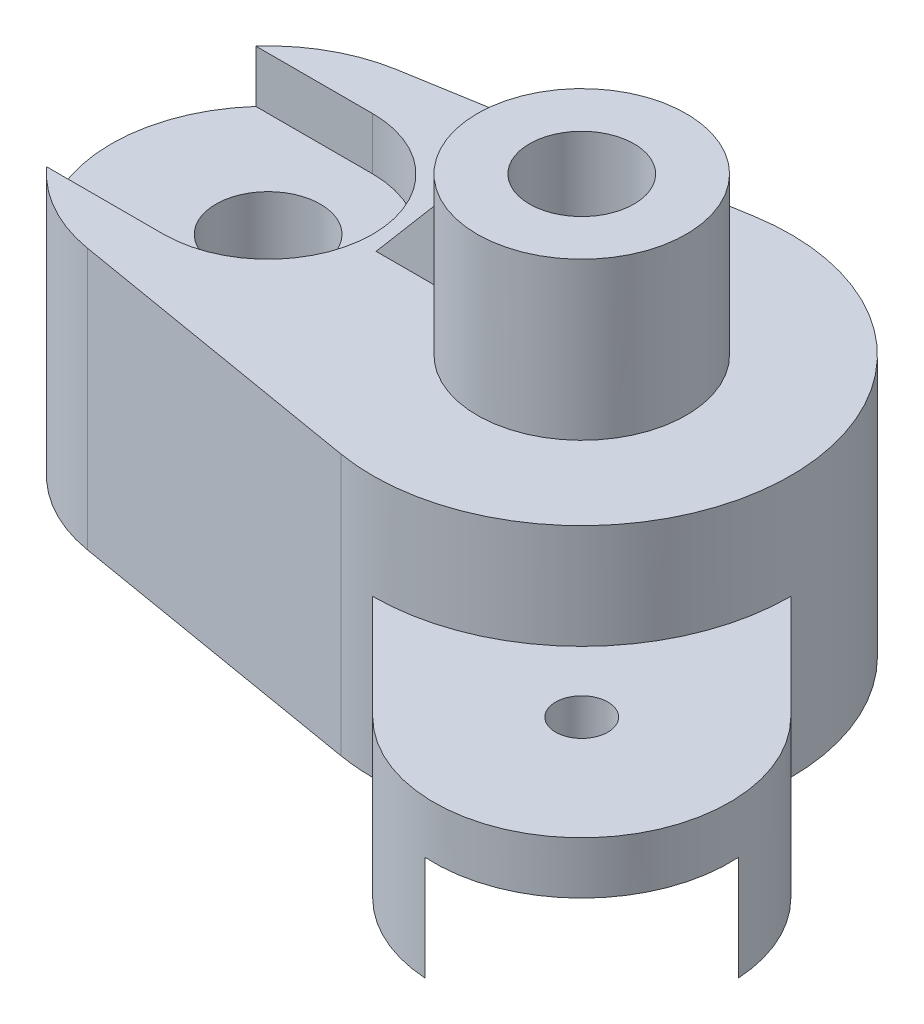
ISO-10303-21;
HEADER;
FILE_DESCRIPTION(('STEP AP214'),'2;1');
FILE_NAME('part.step','',(''),(''),'','','');
FILE_SCHEMA(('AUTOMOTIVE_DESIGN { 1 0 10303 214 1 1 1 1 }'));
ENDSEC;
DATA;
#1=APPLICATION_CONTEXT('core data for automotive mechanical design processes');
#2=APPLICATION_PROTOCOL_DEFINITION('international standard','automotive_design',2000,#1);
#3=PRODUCT_CONTEXT('',#1,'mechanical');
#4=PRODUCT('Part','Part','',(#3));
#5=PRODUCT_RELATED_PRODUCT_CATEGORY('part','',(#4));
#6=PRODUCT_DEFINITION_FORMATION('','',#4);
#7=PRODUCT_DEFINITION_CONTEXT('part definition',#1,'design');
#8=PRODUCT_DEFINITION('design','',#6,#7);
#9=PRODUCT_DEFINITION_SHAPE('','',#8);
#10=(LENGTH_UNIT() NAMED_UNIT(*) SI_UNIT(.MILLI.,.METRE.));
#11=(NAMED_UNIT(*) PLANE_ANGLE_UNIT() SI_UNIT($,.RADIAN.));
#12=(NAMED_UNIT(*) SI_UNIT($,.STERADIAN.) SOLID_ANGLE_UNIT());
#13=UNCERTAINTY_MEASURE_WITH_UNIT(LENGTH_MEASURE(1.E-05),#10,'distance_accuracy_value','');
#14=(GEOMETRIC_REPRESENTATION_CONTEXT(3) GLOBAL_UNCERTAINTY_ASSIGNED_CONTEXT((#13)) GLOBAL_UNIT_ASSIGNED_CONTEXT((#10,
#11,#12)) REPRESENTATION_CONTEXT('',''));
#15=CARTESIAN_POINT('',(0.,0.,0.));
#16=DIRECTION('',(0.,0.,1.));
#17=DIRECTION('',(1.,0.,0.));
#18=AXIS2_PLACEMENT_3D('',#15,#16,#17);
#19=CARTESIAN_POINT('',(0.,0.,0.));
#20=DIRECTION('',(0.,1.,0.));
#21=DIRECTION('',(0.,0.,1.));
#22=AXIS2_PLACEMENT_3D('',#19,#20,#21);
#23=PLANE('',#22);
#24=CARTESIAN_POINT('',(0.,0.,0.));
#25=DIRECTION('',(0.,-1.,0.));
#26=DIRECTION('',(0.,0.,-1.));
#27=AXIS2_PLACEMENT_3D('',#24,#25,#26);
#28=CIRCLE('',#27,30.);
#29=CARTESIAN_POINT('',(-22.3606797749979,0.,-20.));
#30=VERTEX_POINT('',#29);
#31=CARTESIAN_POINT('',(30.,0.,0.));
#32=VERTEX_POINT('',#31);
#33=EDGE_CURVE('E330',#30,#32,#28,.T.);
#34=ORIENTED_EDGE('',*,*,#33,.F.);
#35=DIRECTION('',(1.,0.,0.));
#36=VECTOR('',#35,1.);
#37=CARTESIAN_POINT('',(-105.611257837437,0.,-20.));
#38=LINE('',#37,#36);
#39=CARTESIAN_POINT('',(-82.3606797749979,0.,-20.));
#40=VERTEX_POINT('',#39);
#41=EDGE_CURVE('E423',#40,#30,#38,.T.);
#42=ORIENTED_EDGE('',*,*,#41,.F.);
#43=CARTESIAN_POINT('',(-60.,0.,0.));
#44=DIRECTION('',(0.,1.,0.));
#45=DIRECTION('',(0.,0.,1.));
#46=AXIS2_PLACEMENT_3D('',#43,#44,#45);
#47=CIRCLE('',#46,30.);
#48=CARTESIAN_POINT('',(-65.,0.,-29.5803989154981));
#49=VERTEX_POINT('',#48);
#50=EDGE_CURVE('E356',#49,#40,#47,.T.);
#51=ORIENTED_EDGE('',*,*,#50,.F.);
#52=DIRECTION('',(-0.986013297183269,0.,0.166666666666667));
#53=VECTOR('',#52,1.);
#54=CARTESIAN_POINT('',(-6.66666666666667,0.,-39.4405318873308));
#55=LINE('',#54,#53);
#56=CARTESIAN_POINT('',(-6.66666666666667,0.,-39.4405318873308));
#57=VERTEX_POINT('',#56);
#58=EDGE_CURVE('E335',#57,#49,#55,.T.);
#59=ORIENTED_EDGE('',*,*,#58,.F.);
#60=CARTESIAN_POINT('',(0.,0.,0.));
#61=DIRECTION('',(0.,1.,0.));
#62=DIRECTION('',(0.,0.,1.));
#63=AXIS2_PLACEMENT_3D('',#60,#61,#62);
#64=CIRCLE('',#63,40.);
#65=CARTESIAN_POINT('',(40.,0.,0.));
#66=VERTEX_POINT('',#65);
#67=EDGE_CURVE('E362',#66,#57,#64,.T.);
#68=ORIENTED_EDGE('',*,*,#67,.F.);
#69=DIRECTION('',(0.707106781186551,0.,0.707106781186544));
#70=VECTOR('',#69,1.);
#71=CARTESIAN_POINT('',(19.9999999999998,0.,-20.));
#72=LINE('',#71,#70);
#73=CARTESIAN_POINT('',(59.9999999999999,0.,19.9999999999997));
#74=VERTEX_POINT('',#73);
#75=EDGE_CURVE('E257',#66,#74,#72,.T.);
#76=ORIENTED_EDGE('',*,*,#75,.T.);
#77=CARTESIAN_POINT('',(40.,0.,39.9999999999996));
#78=DIRECTION('',(0.,-1.,0.));
#79=DIRECTION('',(0.,0.,-1.));
#80=AXIS2_PLACEMENT_3D('',#77,#78,#79);
#81=CIRCLE('',#80,28.2842712474619);
#82=CARTESIAN_POINT('',(68.228756555323,0.,38.2287565553237));
#83=VERTEX_POINT('',#82);
#84=EDGE_CURVE('E274',#74,#83,#81,.T.);
#85=ORIENTED_EDGE('',*,*,#84,.T.);
#86=DIRECTION('',(-0.707106781186542,0.,-0.707106781186554));
#87=VECTOR('',#86,1.);
#88=CARTESIAN_POINT('',(15.0000000000002,0.,-15.));
#89=LINE('',#88,#87);
#90=EDGE_CURVE('E220',#83,#32,#89,.T.);
#91=ORIENTED_EDGE('',*,*,#90,.T.);
#92=EDGE_LOOP('',(#34,#42,#51,#59,#68,#76,#85,#91));
#93=FACE_BOUND('',#92,.T.);
#94=ADVANCED_FACE('F35',(#93),#23,.F.);
#95=CARTESIAN_POINT('',(0.,50.,0.));
#96=DIRECTION('',(0.,1.,0.));
#97=DIRECTION('',(0.,0.,1.));
#98=AXIS2_PLACEMENT_3D('',#95,#96,#97);
#99=PLANE('',#98);
#100=DIRECTION('',(0.,0.,1.));
#101=VECTOR('',#100,1.);
#102=CARTESIAN_POINT('',(-36.8431348329844,50.,-2.5));
#103=LINE('',#102,#101);
#104=CARTESIAN_POINT('',(-36.8431348329844,50.,-2.5));
#105=VERTEX_POINT('',#104);
#106=CARTESIAN_POINT('',(-36.8431348329844,50.,2.5));
#107=VERTEX_POINT('',#106);
#108=EDGE_CURVE('E58',#105,#107,#103,.T.);
#109=ORIENTED_EDGE('',*,*,#108,.F.);
#110=DIRECTION('',(-1.,0.,0.));
#111=VECTOR('',#110,1.);
#112=CARTESIAN_POINT('',(-19.8431348329844,50.,-2.49999999999999));
#113=LINE('',#112,#111);
#114=CARTESIAN_POINT('',(-19.8431348329844,50.,-2.49999999999999));
#115=VERTEX_POINT('',#114);
#116=EDGE_CURVE('E440',#115,#105,#113,.T.);
#117=ORIENTED_EDGE('',*,*,#116,.F.);
#118=CARTESIAN_POINT('',(0.,50.,0.));
#119=DIRECTION('',(0.,1.,0.));
#120=DIRECTION('',(0.,0.,1.));
#121=AXIS2_PLACEMENT_3D('',#118,#119,#120);
#122=CIRCLE('',#121,20.);
#123=CARTESIAN_POINT('',(-19.8431348329844,50.,2.5));
#124=VERTEX_POINT('',#123);
#125=EDGE_CURVE('E326',#124,#115,#122,.T.);
#126=ORIENTED_EDGE('',*,*,#125,.F.);
#127=DIRECTION('',(1.,0.,0.));
#128=VECTOR('',#127,1.);
#129=CARTESIAN_POINT('',(-19.8431348329844,50.,2.5));
#130=LINE('',#129,#128);
#131=EDGE_CURVE('E218',#107,#124,#130,.T.);
#132=ORIENTED_EDGE('',*,*,#131,.F.);
#133=EDGE_LOOP('',(#109,#117,#126,#132));
#134=FACE_BOUND('',#133,.T.);
#135=CARTESIAN_POINT('',(-60.,50.,0.));
#136=DIRECTION('',(0.,1.,0.));
#137=DIRECTION('',(0.,0.,1.));
#138=AXIS2_PLACEMENT_3D('',#135,#136,#137);
#139=CIRCLE('',#138,20.);
#140=CARTESIAN_POINT('',(-60.,50.,-20.));
#141=VERTEX_POINT('',#140);
#142=CARTESIAN_POINT('',(-60.,50.,20.));
#143=VERTEX_POINT('',#142);
#144=EDGE_CURVE('E282',#141,#143,#139,.F.);
#145=ORIENTED_EDGE('',*,*,#144,.T.);
#146=DIRECTION('',(-1.,0.,0.));
#147=VECTOR('',#146,1.);
#148=CARTESIAN_POINT('',(0.,50.,20.));
#149=LINE('',#148,#147);
#150=CARTESIAN_POINT('',(-82.3606797749978,50.,20.));
#151=VERTEX_POINT('',#150);
#152=EDGE_CURVE('E294',#143,#151,#149,.T.);
#153=ORIENTED_EDGE('',*,*,#152,.T.);
#154=CARTESIAN_POINT('',(-60.,50.,0.));
#155=DIRECTION('',(0.,1.,0.));
#156=DIRECTION('',(0.,0.,-1.));
#157=AXIS2_PLACEMENT_3D('',#154,#155,#156);
#158=CIRCLE('',#157,29.9999999999999);
#159=CARTESIAN_POINT('',(-65.,50.,29.5803989154981));
#160=VERTEX_POINT('',#159);
#161=EDGE_CURVE('E345',#151,#160,#158,.T.);
#162=ORIENTED_EDGE('',*,*,#161,.T.);
#163=DIRECTION('',(0.986013297183269,0.,0.166666666666667));
#164=VECTOR('',#163,1.);
#165=CARTESIAN_POINT('',(-65.,50.,29.5803989154981));
#166=LINE('',#165,#164);
#167=CARTESIAN_POINT('',(-6.66666666666666,50.,39.4405318873308));
#168=VERTEX_POINT('',#167);
#169=EDGE_CURVE('E349',#160,#168,#166,.T.);
#170=ORIENTED_EDGE('',*,*,#169,.T.);
#171=CARTESIAN_POINT('',(0.,50.,0.));
#172=DIRECTION('',(0.,1.,0.));
#173=DIRECTION('',(0.,0.,1.));
#174=AXIS2_PLACEMENT_3D('',#171,#172,#173);
#175=CIRCLE('',#174,40.);
#176=CARTESIAN_POINT('',(-6.66666666666667,50.,-39.4405318873308));
#177=VERTEX_POINT('',#176);
#178=EDGE_CURVE('E339',#168,#177,#175,.T.);
#179=ORIENTED_EDGE('',*,*,#178,.T.);
#180=DIRECTION('',(-0.986013297183269,0.,0.166666666666667));
#181=VECTOR('',#180,1.);
#182=CARTESIAN_POINT('',(-6.66666666666667,50.,-39.4405318873308));
#183=LINE('',#182,#181);
#184=CARTESIAN_POINT('',(-65.,50.,-29.5803989154981));
#185=VERTEX_POINT('',#184);
#186=EDGE_CURVE('E342',#177,#185,#183,.T.);
#187=ORIENTED_EDGE('',*,*,#186,.T.);
#188=CARTESIAN_POINT('',(-82.3606797749979,50.,-20.));
#189=VERTEX_POINT('',#188);
#190=EDGE_CURVE('E346',#185,#189,#158,.T.);
#191=ORIENTED_EDGE('',*,*,#190,.T.);
#192=DIRECTION('',(-1.,0.,0.));
#193=VECTOR('',#192,1.);
#194=CARTESIAN_POINT('',(0.,50.,-20.));
#195=LINE('',#194,#193);
#196=EDGE_CURVE('E307',#141,#189,#195,.T.);
#197=ORIENTED_EDGE('',*,*,#196,.F.);
#198=EDGE_LOOP('',(#145,#153,#162,#170,#179,#187,#191,#197));
#199=FACE_BOUND('',#198,.T.);
#200=ADVANCED_FACE('F400',(#134,#199),#99,.T.);
#201=CARTESIAN_POINT('',(0.,80.,0.));
#202=DIRECTION('',(0.,-1.,0.));
#203=DIRECTION('',(0.,0.,-1.));
#204=AXIS2_PLACEMENT_3D('',#201,#202,#203);
#205=CYLINDRICAL_SURFACE('',#204,20.);
#206=CARTESIAN_POINT('',(0.,80.,0.));
#207=DIRECTION('',(0.,1.,0.));
#208=DIRECTION('',(0.,0.,1.));
#209=AXIS2_PLACEMENT_3D('',#206,#207,#208);
#210=CIRCLE('',#209,20.);
#211=CARTESIAN_POINT('',(0.,80.,20.));
#212=VERTEX_POINT('',#211);
#213=EDGE_CURVE('E327',#212,#212,#210,.T.);
#214=ORIENTED_EDGE('',*,*,#213,.F.);
#215=EDGE_LOOP('',(#214));
#216=FACE_BOUND('',#215,.T.);
#217=DIRECTION('',(0.,-1.,0.));
#218=VECTOR('',#217,1.);
#219=CARTESIAN_POINT('',(-19.8431348329844,70.,-2.49999999999999));
#220=LINE('',#219,#218);
#221=CARTESIAN_POINT('',(-19.8431348329844,70.,-2.5));
#222=VERTEX_POINT('',#221);
#223=EDGE_CURVE('E214',#222,#115,#220,.T.);
#224=ORIENTED_EDGE('',*,*,#223,.F.);
#225=CARTESIAN_POINT('',(0.,70.,0.));
#226=DIRECTION('',(0.,-1.,0.));
#227=DIRECTION('',(0.,0.,-1.));
#228=AXIS2_PLACEMENT_3D('',#225,#226,#227);
#229=CIRCLE('',#228,20.);
#230=CARTESIAN_POINT('',(-19.8431348329844,70.,2.50000000000001));
#231=VERTEX_POINT('',#230);
#232=EDGE_CURVE('E196',#231,#222,#229,.T.);
#233=ORIENTED_EDGE('',*,*,#232,.F.);
#234=DIRECTION('',(0.,-1.,0.));
#235=VECTOR('',#234,1.);
#236=CARTESIAN_POINT('',(-19.8431348329844,70.,2.5));
#237=LINE('',#236,#235);
#238=EDGE_CURVE('E211',#231,#124,#237,.T.);
#239=ORIENTED_EDGE('',*,*,#238,.T.);
#240=ORIENTED_EDGE('',*,*,#125,.T.);
#241=EDGE_LOOP('',(#224,#233,#239,#240));
#242=FACE_BOUND('',#241,.T.);
#243=ADVANCED_FACE('F209',(#216,#242),#205,.T.);
#244=CARTESIAN_POINT('',(-82.3606797749979,0.,20.));
#245=VERTEX_POINT('',#244);
#246=CARTESIAN_POINT('',(-65.,0.,29.5803989154981));
#247=VERTEX_POINT('',#246);
#248=EDGE_CURVE('E355',#245,#247,#47,.T.);
#249=ORIENTED_EDGE('',*,*,#248,.F.);
#250=DIRECTION('',(-1.,0.,0.));
#251=VECTOR('',#250,1.);
#252=CARTESIAN_POINT('',(-105.611257837437,0.,20.));
#253=LINE('',#252,#251);
#254=CARTESIAN_POINT('',(-22.3606797749979,0.,20.));
#255=VERTEX_POINT('',#254);
#256=EDGE_CURVE('E390',#255,#245,#253,.T.);
#257=ORIENTED_EDGE('',*,*,#256,.F.);
#258=CARTESIAN_POINT('',(0.,0.,30.));
#259=VERTEX_POINT('',#258);
#260=EDGE_CURVE('E336',#259,#255,#28,.T.);
#261=ORIENTED_EDGE('',*,*,#260,.F.);
#262=DIRECTION('',(-0.707106781186541,0.,-0.707106781186554));
#263=VECTOR('',#262,1.);
#264=CARTESIAN_POINT('',(-15.,0.,14.9999999999997));
#265=LINE('',#264,#263);
#266=CARTESIAN_POINT('',(38.2287565553218,0.,68.2287565553225));
#267=VERTEX_POINT('',#266);
#268=EDGE_CURVE('E228',#267,#259,#265,.T.);
#269=ORIENTED_EDGE('',*,*,#268,.F.);
#270=CARTESIAN_POINT('',(20.0000000000001,0.,59.9999999999999));
#271=VERTEX_POINT('',#270);
#272=EDGE_CURVE('E273',#267,#271,#81,.T.);
#273=ORIENTED_EDGE('',*,*,#272,.T.);
#274=DIRECTION('',(0.707106781186551,0.,0.707106781186544));
#275=VECTOR('',#274,1.);
#276=CARTESIAN_POINT('',(-20.,0.,20.0000000000002));
#277=LINE('',#276,#275);
#278=CARTESIAN_POINT('',(0.,0.,40.));
#279=VERTEX_POINT('',#278);
#280=EDGE_CURVE('E262',#279,#271,#277,.T.);
#281=ORIENTED_EDGE('',*,*,#280,.F.);
#282=CARTESIAN_POINT('',(-6.66666666666666,0.,39.4405318873308));
#283=VERTEX_POINT('',#282);
#284=EDGE_CURVE('E343',#283,#279,#64,.T.);
#285=ORIENTED_EDGE('',*,*,#284,.F.);
#286=DIRECTION('',(0.986013297183269,0.,0.166666666666667));
#287=VECTOR('',#286,1.);
#288=CARTESIAN_POINT('',(-65.,0.,29.5803989154981));
#289=LINE('',#288,#287);
#290=EDGE_CURVE('E359',#247,#283,#289,.T.);
#291=ORIENTED_EDGE('',*,*,#290,.F.);
#292=EDGE_LOOP('',(#249,#257,#261,#269,#273,#281,#285,#291));
#293=FACE_BOUND('',#292,.T.);
#294=ADVANCED_FACE('F388',(#293),#23,.F.);
#295=CARTESIAN_POINT('',(0.,30.,0.));
#296=DIRECTION('',(0.,-1.,0.));
#297=DIRECTION('',(0.,0.,-1.));
#298=AXIS2_PLACEMENT_3D('',#295,#296,#297);
#299=CYLINDRICAL_SURFACE('',#298,30.);
#300=CARTESIAN_POINT('',(0.,30.,0.));
#301=DIRECTION('',(0.,-1.,0.));
#302=DIRECTION('',(0.,0.,-1.));
#303=AXIS2_PLACEMENT_3D('',#300,#301,#302);
#304=CIRCLE('',#303,30.);
#305=CARTESIAN_POINT('',(0.,30.,-30.));
#306=VERTEX_POINT('',#305);
#307=EDGE_CURVE('E332',#306,#306,#304,.T.);
#308=ORIENTED_EDGE('',*,*,#307,.F.);
#309=EDGE_LOOP('',(#308));
#310=FACE_BOUND('',#309,.T.);
#311=CARTESIAN_POINT('',(0.,20.,0.));
#312=DIRECTION('',(0.,1.,0.));
#313=DIRECTION('',(0.,0.,1.));
#314=AXIS2_PLACEMENT_3D('',#311,#312,#313);
#315=CIRCLE('',#314,30.);
#316=CARTESIAN_POINT('',(-22.3606797749979,20.,20.));
#317=VERTEX_POINT('',#316);
#318=CARTESIAN_POINT('',(-22.3606797749979,20.,-20.));
#319=VERTEX_POINT('',#318);
#320=EDGE_CURVE('E432',#317,#319,#315,.F.);
#321=ORIENTED_EDGE('',*,*,#320,.T.);
#322=DIRECTION('',(0.,-1.,0.));
#323=VECTOR('',#322,1.);
#324=CARTESIAN_POINT('',(-22.3606797749979,30.,-20.));
#325=LINE('',#324,#323);
#326=EDGE_CURVE('E438',#319,#30,#325,.T.);
#327=ORIENTED_EDGE('',*,*,#326,.T.);
#328=ORIENTED_EDGE('',*,*,#33,.T.);
#329=DIRECTION('',(0.,-1.,0.));
#330=VECTOR('',#329,1.);
#331=CARTESIAN_POINT('',(30.,20.,0.));
#332=LINE('',#331,#330);
#333=CARTESIAN_POINT('',(30.,20.,0.));
#334=VERTEX_POINT('',#333);
#335=EDGE_CURVE('E244',#334,#32,#332,.T.);
#336=ORIENTED_EDGE('',*,*,#335,.F.);
#337=CARTESIAN_POINT('',(0.,20.,0.));
#338=DIRECTION('',(0.,-1.,0.));
#339=DIRECTION('',(0.,0.,-1.));
#340=AXIS2_PLACEMENT_3D('',#337,#338,#339);
#341=CIRCLE('',#340,30.);
#342=CARTESIAN_POINT('',(0.,20.,30.));
#343=VERTEX_POINT('',#342);
#344=EDGE_CURVE('E234',#343,#334,#341,.F.);
#345=ORIENTED_EDGE('',*,*,#344,.F.);
#346=DIRECTION('',(0.,-1.,0.));
#347=VECTOR('',#346,1.);
#348=CARTESIAN_POINT('',(0.,20.,30.));
#349=LINE('',#348,#347);
#350=EDGE_CURVE('E248',#343,#259,#349,.T.);
#351=ORIENTED_EDGE('',*,*,#350,.T.);
#352=ORIENTED_EDGE('',*,*,#260,.T.);
#353=DIRECTION('',(0.,-1.,0.));
#354=VECTOR('',#353,1.);
#355=CARTESIAN_POINT('',(-22.3606797749979,30.,20.));
#356=LINE('',#355,#354);
#357=EDGE_CURVE('E435',#255,#317,#356,.F.);
#358=ORIENTED_EDGE('',*,*,#357,.T.);
#359=EDGE_LOOP('',(#321,#327,#328,#336,#345,#351,#352,#358));
#360=FACE_BOUND('',#359,.T.);
#361=ADVANCED_FACE('F455',(#310,#360),#299,.F.);
#362=CARTESIAN_POINT('',(40.,30.,39.9999999999996));
#363=DIRECTION('',(0.,-1.,0.));
#364=DIRECTION('',(0.,0.,-1.));
#365=AXIS2_PLACEMENT_3D('',#362,#363,#364);
#366=CYLINDRICAL_SURFACE('',#365,28.2842712474619);
#367=CARTESIAN_POINT('',(40.,20.,39.9999999999996));
#368=DIRECTION('',(0.,-1.,0.));
#369=DIRECTION('',(0.,0.,-1.));
#370=AXIS2_PLACEMENT_3D('',#367,#368,#369);
#371=CIRCLE('',#370,28.2842712474619);
#372=CARTESIAN_POINT('',(68.228756555323,20.,38.2287565553237));
#373=VERTEX_POINT('',#372);
#374=CARTESIAN_POINT('',(38.2287565553218,20.,68.2287565553225));
#375=VERTEX_POINT('',#374);
#376=EDGE_CURVE('E227',#373,#375,#371,.T.);
#377=ORIENTED_EDGE('',*,*,#376,.F.);
#378=DIRECTION('',(0.,-1.,0.));
#379=VECTOR('',#378,1.);
#380=CARTESIAN_POINT('',(68.228756555323,20.,38.2287565553237));
#381=LINE('',#380,#379);
#382=EDGE_CURVE('E240',#373,#83,#381,.T.);
#383=ORIENTED_EDGE('',*,*,#382,.T.);
#384=ORIENTED_EDGE('',*,*,#84,.F.);
#385=DIRECTION('',(0.,-1.,0.));
#386=VECTOR('',#385,1.);
#387=CARTESIAN_POINT('',(59.9999999999999,30.,19.9999999999997));
#388=LINE('',#387,#386);
#389=CARTESIAN_POINT('',(59.9999999999999,30.,19.9999999999997));
#390=VERTEX_POINT('',#389);
#391=EDGE_CURVE('E270',#390,#74,#388,.T.);
#392=ORIENTED_EDGE('',*,*,#391,.F.);
#393=CARTESIAN_POINT('',(40.,30.,39.9999999999996));
#394=DIRECTION('',(0.,-1.,0.));
#395=DIRECTION('',(0.,0.,-1.));
#396=AXIS2_PLACEMENT_3D('',#393,#394,#395);
#397=CIRCLE('',#396,28.2842712474619);
#398=CARTESIAN_POINT('',(20.0000000000001,30.,59.9999999999999));
#399=VERTEX_POINT('',#398);
#400=EDGE_CURVE('E261',#390,#399,#397,.T.);
#401=ORIENTED_EDGE('',*,*,#400,.T.);
#402=DIRECTION('',(0.,-1.,0.));
#403=VECTOR('',#402,1.);
#404=CARTESIAN_POINT('',(20.0000000000001,30.,59.9999999999999));
#405=LINE('',#404,#403);
#406=EDGE_CURVE('E286',#399,#271,#405,.T.);
#407=ORIENTED_EDGE('',*,*,#406,.T.);
#408=ORIENTED_EDGE('',*,*,#272,.F.);
#409=DIRECTION('',(0.,-1.,0.));
#410=VECTOR('',#409,1.);
#411=CARTESIAN_POINT('',(38.2287565553218,20.,68.2287565553225));
#412=LINE('',#411,#410);
#413=EDGE_CURVE('E251',#375,#267,#412,.T.);
#414=ORIENTED_EDGE('',*,*,#413,.F.);
#415=EDGE_LOOP('',(#377,#383,#384,#392,#401,#407,#408,#414));
#416=FACE_BOUND('',#415,.T.);
#417=ADVANCED_FACE('F472',(#416),#366,.T.);
#418=CARTESIAN_POINT('',(40.,30.,39.9999999999996));
#419=DIRECTION('',(0.,-1.,0.));
#420=DIRECTION('',(0.,0.,-1.));
#421=AXIS2_PLACEMENT_3D('',#418,#419,#420);
#422=CYLINDRICAL_SURFACE('',#421,5.);
#423=CARTESIAN_POINT('',(40.,30.,39.9999999999996));
#424=DIRECTION('',(0.,-1.,0.));
#425=DIRECTION('',(0.,0.,-1.));
#426=AXIS2_PLACEMENT_3D('',#423,#424,#425);
#427=CIRCLE('',#426,5.);
#428=CARTESIAN_POINT('',(40.,30.,34.9999999999996));
#429=VERTEX_POINT('',#428);
#430=EDGE_CURVE('E247',#429,#429,#427,.T.);
#431=ORIENTED_EDGE('',*,*,#430,.F.);
#432=EDGE_LOOP('',(#431));
#433=FACE_BOUND('',#432,.T.);
#434=CARTESIAN_POINT('',(40.,20.,39.9999999999996));
#435=DIRECTION('',(0.,-1.,0.));
#436=DIRECTION('',(0.,0.,-1.));
#437=AXIS2_PLACEMENT_3D('',#434,#435,#436);
#438=CIRCLE('',#437,5.);
#439=CARTESIAN_POINT('',(40.,20.,34.9999999999996));
#440=VERTEX_POINT('',#439);
#441=EDGE_CURVE('E237',#440,#440,#438,.F.);
#442=ORIENTED_EDGE('',*,*,#441,.F.);
#443=EDGE_LOOP('',(#442));
#444=FACE_BOUND('',#443,.T.);
#445=ADVANCED_FACE('F465',(#433,#444),#422,.F.);
#446=CARTESIAN_POINT('',(-60.,50.,0.));
#447=DIRECTION('',(0.,-1.,0.));
#448=DIRECTION('',(0.,0.,-1.));
#449=AXIS2_PLACEMENT_3D('',#446,#447,#448);
#450=CYLINDRICAL_SURFACE('',#449,30.);
#451=ORIENTED_EDGE('',*,*,#50,.T.);
#452=DIRECTION('',(0.,-1.,0.));
#453=VECTOR('',#452,1.);
#454=CARTESIAN_POINT('',(-82.3606797749979,50.,-20.));
#455=LINE('',#454,#453);
#456=CARTESIAN_POINT('',(-82.3606797749979,20.,-20.));
#457=VERTEX_POINT('',#456);
#458=EDGE_CURVE('E11',#40,#457,#455,.F.);
#459=ORIENTED_EDGE('',*,*,#458,.T.);
#460=CARTESIAN_POINT('',(-60.,20.,0.));
#461=DIRECTION('',(0.,1.,0.));
#462=DIRECTION('',(0.,0.,1.));
#463=AXIS2_PLACEMENT_3D('',#460,#461,#462);
#464=CIRCLE('',#463,30.);
#465=CARTESIAN_POINT('',(-82.3606797749979,20.,20.));
#466=VERTEX_POINT('',#465);
#467=EDGE_CURVE('E376',#457,#466,#464,.T.);
#468=ORIENTED_EDGE('',*,*,#467,.T.);
#469=DIRECTION('',(0.,-1.,0.));
#470=VECTOR('',#469,1.);
#471=CARTESIAN_POINT('',(-82.3606797749979,50.,20.));
#472=LINE('',#471,#470);
#473=EDGE_CURVE('E43',#466,#245,#472,.T.);
#474=ORIENTED_EDGE('',*,*,#473,.T.);
#475=ORIENTED_EDGE('',*,*,#248,.T.);
#476=DIRECTION('',(0.,-1.,0.));
#477=VECTOR('',#476,1.);
#478=CARTESIAN_POINT('',(-65.,50.,29.5803989154981));
#479=LINE('',#478,#477);
#480=EDGE_CURVE('E366',#160,#247,#479,.T.);
#481=ORIENTED_EDGE('',*,*,#480,.F.);
#482=ORIENTED_EDGE('',*,*,#161,.F.);
#483=DIRECTION('',(0.,1.,0.));
#484=VECTOR('',#483,1.);
#485=CARTESIAN_POINT('',(-82.3606797749978,40.,20.));
#486=LINE('',#485,#484);
#487=CARTESIAN_POINT('',(-82.3606797749978,40.,20.));
#488=VERTEX_POINT('',#487);
#489=EDGE_CURVE('E315',#488,#151,#486,.T.);
#490=ORIENTED_EDGE('',*,*,#489,.F.);
#491=CARTESIAN_POINT('',(-60.,40.,0.));
#492=DIRECTION('',(0.,1.,0.));
#493=DIRECTION('',(0.,0.,1.));
#494=AXIS2_PLACEMENT_3D('',#491,#492,#493);
#495=CIRCLE('',#494,29.9999999999999);
#496=CARTESIAN_POINT('',(-82.3606797749979,40.,-20.));
#497=VERTEX_POINT('',#496);
#498=EDGE_CURVE('E296',#497,#488,#495,.T.);
#499=ORIENTED_EDGE('',*,*,#498,.F.);
#500=DIRECTION('',(0.,1.,0.));
#501=VECTOR('',#500,1.);
#502=CARTESIAN_POINT('',(-82.3606797749979,40.,-20.));
#503=LINE('',#502,#501);
#504=EDGE_CURVE('E317',#497,#189,#503,.T.);
#505=ORIENTED_EDGE('',*,*,#504,.T.);
#506=ORIENTED_EDGE('',*,*,#190,.F.);
#507=DIRECTION('',(0.,-1.,0.));
#508=VECTOR('',#507,1.);
#509=CARTESIAN_POINT('',(-65.,50.,-29.5803989154981));
#510=LINE('',#509,#508);
#511=EDGE_CURVE('E369',#185,#49,#510,.T.);
#512=ORIENTED_EDGE('',*,*,#511,.T.);
#513=EDGE_LOOP('',(#451,#459,#468,#474,#475,#481,#482,#490,#499,#505,#506,#512));
#514=FACE_BOUND('',#513,.T.);
#515=ADVANCED_FACE('F382',(#514),#450,.T.);
#516=CARTESIAN_POINT('',(-60.,-59.,0.));
#517=DIRECTION('',(0.,1.,0.));
#518=DIRECTION('',(0.,0.,1.));
#519=AXIS2_PLACEMENT_3D('',#516,#517,#518);
#520=CYLINDRICAL_SURFACE('',#519,10.);
#521=CARTESIAN_POINT('',(-60.,20.,0.));
#522=DIRECTION('',(0.,1.,0.));
#523=DIRECTION('',(0.,0.,1.));
#524=AXIS2_PLACEMENT_3D('',#521,#522,#523);
#525=CIRCLE('',#524,10.);
#526=CARTESIAN_POINT('',(-60.,20.,9.99999999999997));
#527=VERTEX_POINT('',#526);
#528=EDGE_CURVE('E374',#527,#527,#525,.F.);
#529=ORIENTED_EDGE('',*,*,#528,.T.);
#530=EDGE_LOOP('',(#529));
#531=FACE_BOUND('',#530,.T.);
#532=CARTESIAN_POINT('',(-60.,40.,0.));
#533=DIRECTION('',(0.,1.,0.));
#534=DIRECTION('',(0.,0.,1.));
#535=AXIS2_PLACEMENT_3D('',#532,#533,#534);
#536=CIRCLE('',#535,10.);
#537=CARTESIAN_POINT('',(-60.,40.,9.99999999999997));
#538=VERTEX_POINT('',#537);
#539=EDGE_CURVE('E301',#538,#538,#536,.F.);
#540=ORIENTED_EDGE('',*,*,#539,.F.);
#541=EDGE_LOOP('',(#540));
#542=FACE_BOUND('',#541,.T.);
#543=ADVANCED_FACE('F464',(#531,#542),#520,.F.);
#544=CARTESIAN_POINT('',(-6.66666666666667,50.,-39.4405318873308));
#545=DIRECTION('',(0.166666666666667,0.,0.986013297183269));
#546=DIRECTION('',(0.986013297183269,0.,-0.166666666666667));
#547=AXIS2_PLACEMENT_3D('',#544,#545,#546);
#548=PLANE('',#547);
#549=ORIENTED_EDGE('',*,*,#58,.T.);
#550=ORIENTED_EDGE('',*,*,#511,.F.);
#551=ORIENTED_EDGE('',*,*,#186,.F.);
#552=DIRECTION('',(0.,-1.,0.));
#553=VECTOR('',#552,1.);
#554=CARTESIAN_POINT('',(-6.66666666666667,50.,-39.4405318873308));
#555=LINE('',#554,#553);
#556=EDGE_CURVE('E215',#177,#57,#555,.T.);
#557=ORIENTED_EDGE('',*,*,#556,.T.);
#558=EDGE_LOOP('',(#549,#550,#551,#557));
#559=FACE_BOUND('',#558,.T.);
#560=ADVANCED_FACE('F37',(#559),#548,.F.);
#561=CARTESIAN_POINT('',(-65.,50.,29.5803989154981));
#562=DIRECTION('',(0.166666666666667,0.,-0.986013297183269));
#563=DIRECTION('',(-0.98601329718327,0.,-0.166666666666667));
#564=AXIS2_PLACEMENT_3D('',#561,#562,#563);
#565=PLANE('',#564);
#566=ORIENTED_EDGE('',*,*,#290,.T.);
#567=DIRECTION('',(0.,-1.,0.));
#568=VECTOR('',#567,1.);
#569=CARTESIAN_POINT('',(-6.66666666666666,50.,39.4405318873308));
#570=LINE('',#569,#568);
#571=EDGE_CURVE('E352',#168,#283,#570,.T.);
#572=ORIENTED_EDGE('',*,*,#571,.F.);
#573=ORIENTED_EDGE('',*,*,#169,.F.);
#574=ORIENTED_EDGE('',*,*,#480,.T.);
#575=EDGE_LOOP('',(#566,#572,#573,#574));
#576=FACE_BOUND('',#575,.T.);
#577=ADVANCED_FACE('F394',(#576),#565,.F.);
#578=CARTESIAN_POINT('',(0.,50.,0.));
#579=DIRECTION('',(0.,-1.,0.));
#580=DIRECTION('',(0.,0.,-1.));
#581=AXIS2_PLACEMENT_3D('',#578,#579,#580);
#582=CYLINDRICAL_SURFACE('',#581,40.);
#583=CARTESIAN_POINT('',(0.,30.,0.));
#584=DIRECTION('',(0.,-1.,0.));
#585=DIRECTION('',(0.,0.,-1.));
#586=AXIS2_PLACEMENT_3D('',#583,#584,#585);
#587=CIRCLE('',#586,40.);
#588=CARTESIAN_POINT('',(40.,30.,0.));
#589=VERTEX_POINT('',#588);
#590=CARTESIAN_POINT('',(0.,30.,40.));
#591=VERTEX_POINT('',#590);
#592=EDGE_CURVE('E267',#589,#591,#587,.T.);
#593=ORIENTED_EDGE('',*,*,#592,.F.);
#594=DIRECTION('',(0.,-1.,0.));
#595=VECTOR('',#594,1.);
#596=CARTESIAN_POINT('',(40.,30.,0.));
#597=LINE('',#596,#595);
#598=EDGE_CURVE('E279',#589,#66,#597,.T.);
#599=ORIENTED_EDGE('',*,*,#598,.T.);
#600=ORIENTED_EDGE('',*,*,#67,.T.);
#601=ORIENTED_EDGE('',*,*,#556,.F.);
#602=ORIENTED_EDGE('',*,*,#178,.F.);
#603=ORIENTED_EDGE('',*,*,#571,.T.);
#604=ORIENTED_EDGE('',*,*,#284,.T.);
#605=DIRECTION('',(0.,-1.,0.));
#606=VECTOR('',#605,1.);
#607=CARTESIAN_POINT('',(0.,30.,40.));
#608=LINE('',#607,#606);
#609=EDGE_CURVE('E283',#591,#279,#608,.T.);
#610=ORIENTED_EDGE('',*,*,#609,.F.);
#611=EDGE_LOOP('',(#593,#599,#600,#601,#602,#603,#604,#610));
#612=FACE_BOUND('',#611,.T.);
#613=ADVANCED_FACE('F397',(#612),#582,.T.);
#614=CARTESIAN_POINT('',(0.,30.,0.));
#615=DIRECTION('',(0.,-1.,0.));
#616=DIRECTION('',(0.,0.,-1.));
#617=AXIS2_PLACEMENT_3D('',#614,#615,#616);
#618=PLANE('',#617);
#619=ORIENTED_EDGE('',*,*,#307,.T.);
#620=EDGE_LOOP('',(#619));
#621=FACE_BOUND('',#620,.T.);
#622=ADVANCED_FACE('F461',(#621),#618,.T.);
#623=CARTESIAN_POINT('',(0.,80.,0.));
#624=DIRECTION('',(0.,1.,0.));
#625=DIRECTION('',(0.,0.,1.));
#626=AXIS2_PLACEMENT_3D('',#623,#624,#625);
#627=PLANE('',#626);
#628=CARTESIAN_POINT('',(0.,80.,0.));
#629=DIRECTION('',(0.,1.,0.));
#630=DIRECTION('',(0.,0.,1.));
#631=AXIS2_PLACEMENT_3D('',#628,#629,#630);
#632=CIRCLE('',#631,9.99999999999999);
#633=CARTESIAN_POINT('',(0.,80.,9.99999999999999));
#634=VERTEX_POINT('',#633);
#635=EDGE_CURVE('E314',#634,#634,#632,.T.);
#636=ORIENTED_EDGE('',*,*,#635,.F.);
#637=EDGE_LOOP('',(#636));
#638=FACE_BOUND('',#637,.T.);
#639=ORIENTED_EDGE('',*,*,#213,.T.);
#640=EDGE_LOOP('',(#639));
#641=FACE_BOUND('',#640,.T.);
#642=ADVANCED_FACE('F515',(#638,#641),#627,.T.);
#643=CARTESIAN_POINT('',(0.,50.,0.));
#644=DIRECTION('',(0.,1.,0.));
#645=DIRECTION('',(0.,0.,1.));
#646=AXIS2_PLACEMENT_3D('',#643,#644,#645);
#647=CONICAL_SURFACE('',#646,9.99999999999998,1.02974425867665);
#648=CARTESIAN_POINT('',(0.,43.9913938097244,0.));
#649=VERTEX_POINT('',#648);
#650=VERTEX_LOOP('',#649);
#651=FACE_BOUND('',#650,.T.);
#652=CARTESIAN_POINT('',(0.,50.,0.));
#653=DIRECTION('',(0.,1.,0.));
#654=DIRECTION('',(0.,0.,1.));
#655=AXIS2_PLACEMENT_3D('',#652,#653,#654);
#656=CIRCLE('',#655,9.99999999999998);
#657=CARTESIAN_POINT('',(0.,50.,9.99999999999998));
#658=VERTEX_POINT('',#657);
#659=EDGE_CURVE('E323',#658,#658,#656,.T.);
#660=ORIENTED_EDGE('',*,*,#659,.T.);
#661=EDGE_LOOP('',(#660));
#662=FACE_BOUND('',#661,.T.);
#663=ADVANCED_FACE('F511',(#651,#662),#647,.F.);
#664=CARTESIAN_POINT('',(0.,80.,0.));
#665=DIRECTION('',(0.,1.,0.));
#666=DIRECTION('',(0.,0.,1.));
#667=AXIS2_PLACEMENT_3D('',#664,#665,#666);
#668=CYLINDRICAL_SURFACE('',#667,9.99999999999999);
#669=ORIENTED_EDGE('',*,*,#659,.F.);
#670=EDGE_LOOP('',(#669));
#671=FACE_BOUND('',#670,.T.);
#672=ORIENTED_EDGE('',*,*,#635,.T.);
#673=EDGE_LOOP('',(#672));
#674=FACE_BOUND('',#673,.T.);
#675=ADVANCED_FACE('F506',(#671,#674),#668,.F.);
#676=CARTESIAN_POINT('',(-60.,40.,0.));
#677=DIRECTION('',(0.,1.,0.));
#678=DIRECTION('',(0.,0.,1.));
#679=AXIS2_PLACEMENT_3D('',#676,#677,#678);
#680=CYLINDRICAL_SURFACE('',#679,20.);
#681=ORIENTED_EDGE('',*,*,#144,.F.);
#682=DIRECTION('',(0.,1.,0.));
#683=VECTOR('',#682,1.);
#684=CARTESIAN_POINT('',(-60.,40.,-20.));
#685=LINE('',#684,#683);
#686=CARTESIAN_POINT('',(-60.,40.,-20.));
#687=VERTEX_POINT('',#686);
#688=EDGE_CURVE('E304',#687,#141,#685,.T.);
#689=ORIENTED_EDGE('',*,*,#688,.F.);
#690=CARTESIAN_POINT('',(-60.,40.,0.));
#691=DIRECTION('',(0.,1.,0.));
#692=DIRECTION('',(0.,0.,1.));
#693=AXIS2_PLACEMENT_3D('',#690,#691,#692);
#694=CIRCLE('',#693,20.);
#695=CARTESIAN_POINT('',(-60.,40.,20.));
#696=VERTEX_POINT('',#695);
#697=EDGE_CURVE('E290',#687,#696,#694,.F.);
#698=ORIENTED_EDGE('',*,*,#697,.T.);
#699=DIRECTION('',(0.,1.,0.));
#700=VECTOR('',#699,1.);
#701=CARTESIAN_POINT('',(-60.,40.,20.));
#702=LINE('',#701,#700);
#703=EDGE_CURVE('E311',#696,#143,#702,.T.);
#704=ORIENTED_EDGE('',*,*,#703,.T.);
#705=EDGE_LOOP('',(#681,#689,#698,#704));
#706=FACE_BOUND('',#705,.T.);
#707=ADVANCED_FACE('F502',(#706),#680,.F.);
#708=CARTESIAN_POINT('',(0.,40.,20.));
#709=DIRECTION('',(0.,0.,-1.));
#710=DIRECTION('',(-1.,0.,0.));
#711=AXIS2_PLACEMENT_3D('',#708,#709,#710);
#712=PLANE('',#711);
#713=ORIENTED_EDGE('',*,*,#152,.F.);
#714=ORIENTED_EDGE('',*,*,#703,.F.);
#715=DIRECTION('',(-1.,0.,0.));
#716=VECTOR('',#715,1.);
#717=CARTESIAN_POINT('',(0.,40.,20.));
#718=LINE('',#717,#716);
#719=EDGE_CURVE('E299',#696,#488,#718,.T.);
#720=ORIENTED_EDGE('',*,*,#719,.T.);
#721=ORIENTED_EDGE('',*,*,#489,.T.);
#722=EDGE_LOOP('',(#713,#714,#720,#721));
#723=FACE_BOUND('',#722,.T.);
#724=ADVANCED_FACE('F405',(#723),#712,.T.);
#725=CARTESIAN_POINT('',(0.,40.,-20.));
#726=DIRECTION('',(0.,0.,-1.));
#727=DIRECTION('',(-1.,0.,0.));
#728=AXIS2_PLACEMENT_3D('',#725,#726,#727);
#729=PLANE('',#728);
#730=ORIENTED_EDGE('',*,*,#196,.T.);
#731=ORIENTED_EDGE('',*,*,#504,.F.);
#732=DIRECTION('',(-1.,0.,0.));
#733=VECTOR('',#732,1.);
#734=CARTESIAN_POINT('',(0.,40.,-20.));
#735=LINE('',#734,#733);
#736=EDGE_CURVE('E293',#687,#497,#735,.T.);
#737=ORIENTED_EDGE('',*,*,#736,.F.);
#738=ORIENTED_EDGE('',*,*,#688,.T.);
#739=EDGE_LOOP('',(#730,#731,#737,#738));
#740=FACE_BOUND('',#739,.T.);
#741=ADVANCED_FACE('F414',(#740),#729,.F.);
#742=CARTESIAN_POINT('',(0.,40.,0.));
#743=DIRECTION('',(0.,1.,0.));
#744=DIRECTION('',(0.,0.,1.));
#745=AXIS2_PLACEMENT_3D('',#742,#743,#744);
#746=PLANE('',#745);
#747=ORIENTED_EDGE('',*,*,#697,.F.);
#748=ORIENTED_EDGE('',*,*,#736,.T.);
#749=ORIENTED_EDGE('',*,*,#498,.T.);
#750=ORIENTED_EDGE('',*,*,#719,.F.);
#751=EDGE_LOOP('',(#747,#748,#749,#750));
#752=FACE_BOUND('',#751,.T.);
#753=ORIENTED_EDGE('',*,*,#539,.T.);
#754=EDGE_LOOP('',(#753));
#755=FACE_BOUND('',#754,.T.);
#756=ADVANCED_FACE('F409',(#752,#755),#746,.T.);
#757=CARTESIAN_POINT('',(19.9999999999998,30.,-20.));
#758=DIRECTION('',(0.707106781186544,0.,-0.707106781186551));
#759=DIRECTION('',(-0.707106781186551,0.,-0.707106781186544));
#760=AXIS2_PLACEMENT_3D('',#757,#758,#759);
#761=PLANE('',#760);
#762=ORIENTED_EDGE('',*,*,#75,.F.);
#763=ORIENTED_EDGE('',*,*,#598,.F.);
#764=DIRECTION('',(0.707106781186551,0.,0.707106781186544));
#765=VECTOR('',#764,1.);
#766=CARTESIAN_POINT('',(19.9999999999998,30.,-20.));
#767=LINE('',#766,#765);
#768=EDGE_CURVE('E258',#589,#390,#767,.T.);
#769=ORIENTED_EDGE('',*,*,#768,.T.);
#770=ORIENTED_EDGE('',*,*,#391,.T.);
#771=EDGE_LOOP('',(#762,#763,#769,#770));
#772=FACE_BOUND('',#771,.T.);
#773=ADVANCED_FACE('F492',(#772),#761,.T.);
#774=CARTESIAN_POINT('',(-20.,30.,20.0000000000002));
#775=DIRECTION('',(0.707106781186544,0.,-0.707106781186551));
#776=DIRECTION('',(-0.707106781186551,0.,-0.707106781186544));
#777=AXIS2_PLACEMENT_3D('',#774,#775,#776);
#778=PLANE('',#777);
#779=ORIENTED_EDGE('',*,*,#280,.T.);
#780=ORIENTED_EDGE('',*,*,#406,.F.);
#781=DIRECTION('',(0.707106781186551,0.,0.707106781186544));
#782=VECTOR('',#781,1.);
#783=CARTESIAN_POINT('',(-20.,30.,20.0000000000002));
#784=LINE('',#783,#782);
#785=EDGE_CURVE('E265',#591,#399,#784,.T.);
#786=ORIENTED_EDGE('',*,*,#785,.F.);
#787=ORIENTED_EDGE('',*,*,#609,.T.);
#788=EDGE_LOOP('',(#779,#780,#786,#787));
#789=FACE_BOUND('',#788,.T.);
#790=ADVANCED_FACE('F489',(#789),#778,.F.);
#791=CARTESIAN_POINT('',(0.,30.,0.));
#792=DIRECTION('',(0.,-1.,0.));
#793=DIRECTION('',(0.,0.,-1.));
#794=AXIS2_PLACEMENT_3D('',#791,#792,#793);
#795=PLANE('',#794);
#796=ORIENTED_EDGE('',*,*,#430,.T.);
#797=EDGE_LOOP('',(#796));
#798=FACE_BOUND('',#797,.T.);
#799=ORIENTED_EDGE('',*,*,#768,.F.);
#800=ORIENTED_EDGE('',*,*,#592,.T.);
#801=ORIENTED_EDGE('',*,*,#785,.T.);
#802=ORIENTED_EDGE('',*,*,#400,.F.);
#803=EDGE_LOOP('',(#799,#800,#801,#802));
#804=FACE_BOUND('',#803,.T.);
#805=ADVANCED_FACE('F486',(#798,#804),#795,.F.);
#806=CARTESIAN_POINT('',(15.0000000000002,20.,-15.));
#807=DIRECTION('',(-0.707106781186554,0.,0.707106781186542));
#808=DIRECTION('',(0.707106781186542,0.,0.707106781186554));
#809=AXIS2_PLACEMENT_3D('',#806,#807,#808);
#810=PLANE('',#809);
#811=ORIENTED_EDGE('',*,*,#90,.F.);
#812=ORIENTED_EDGE('',*,*,#382,.F.);
#813=DIRECTION('',(-0.707106781186542,0.,-0.707106781186554));
#814=VECTOR('',#813,1.);
#815=CARTESIAN_POINT('',(15.0000000000002,20.,-15.));
#816=LINE('',#815,#814);
#817=EDGE_CURVE('E225',#373,#334,#816,.T.);
#818=ORIENTED_EDGE('',*,*,#817,.T.);
#819=ORIENTED_EDGE('',*,*,#335,.T.);
#820=EDGE_LOOP('',(#811,#812,#818,#819));
#821=FACE_BOUND('',#820,.T.);
#822=ADVANCED_FACE('F484',(#821),#810,.T.);
#823=CARTESIAN_POINT('',(-15.,20.,14.9999999999997));
#824=DIRECTION('',(-0.707106781186554,0.,0.707106781186541));
#825=DIRECTION('',(0.707106781186541,0.,0.707106781186554));
#826=AXIS2_PLACEMENT_3D('',#823,#824,#825);
#827=PLANE('',#826);
#828=ORIENTED_EDGE('',*,*,#268,.T.);
#829=ORIENTED_EDGE('',*,*,#350,.F.);
#830=DIRECTION('',(-0.707106781186541,0.,-0.707106781186554));
#831=VECTOR('',#830,1.);
#832=CARTESIAN_POINT('',(-15.,20.,14.9999999999997));
#833=LINE('',#832,#831);
#834=EDGE_CURVE('E231',#375,#343,#833,.T.);
#835=ORIENTED_EDGE('',*,*,#834,.F.);
#836=ORIENTED_EDGE('',*,*,#413,.T.);
#837=EDGE_LOOP('',(#828,#829,#835,#836));
#838=FACE_BOUND('',#837,.T.);
#839=ADVANCED_FACE('F548',(#838),#827,.F.);
#840=CARTESIAN_POINT('',(0.,20.,0.));
#841=DIRECTION('',(0.,-1.,0.));
#842=DIRECTION('',(0.,0.,-1.));
#843=AXIS2_PLACEMENT_3D('',#840,#841,#842);
#844=PLANE('',#843);
#845=ORIENTED_EDGE('',*,*,#817,.F.);
#846=ORIENTED_EDGE('',*,*,#376,.T.);
#847=ORIENTED_EDGE('',*,*,#834,.T.);
#848=ORIENTED_EDGE('',*,*,#344,.T.);
#849=EDGE_LOOP('',(#845,#846,#847,#848));
#850=FACE_BOUND('',#849,.T.);
#851=ORIENTED_EDGE('',*,*,#441,.T.);
#852=EDGE_LOOP('',(#851));
#853=FACE_BOUND('',#852,.T.);
#854=ADVANCED_FACE('F546',(#850,#853),#844,.T.);
#855=CARTESIAN_POINT('',(-19.8431348329844,70.,-2.49999999999999));
#856=DIRECTION('',(0.,0.,1.));
#857=DIRECTION('',(1.,0.,0.));
#858=AXIS2_PLACEMENT_3D('',#855,#856,#857);
#859=PLANE('',#858);
#860=ORIENTED_EDGE('',*,*,#116,.T.);
#861=DIRECTION('',(0.64764842009554,0.761939317759459,0.));
#862=VECTOR('',#861,1.);
#863=CARTESIAN_POINT('',(-19.8431348329844,70.,-2.49999999999999));
#864=LINE('',#863,#862);
#865=EDGE_CURVE('E198',#105,#222,#864,.T.);
#866=ORIENTED_EDGE('',*,*,#865,.T.);
#867=ORIENTED_EDGE('',*,*,#223,.T.);
#868=EDGE_LOOP('',(#860,#866,#867));
#869=FACE_BOUND('',#868,.T.);
#870=ADVANCED_FACE('F443',(#869),#859,.F.);
#871=CARTESIAN_POINT('',(-19.8431348329844,70.,2.5));
#872=DIRECTION('',(0.,0.,-1.));
#873=DIRECTION('',(-1.,0.,0.));
#874=AXIS2_PLACEMENT_3D('',#871,#872,#873);
#875=PLANE('',#874);
#876=ORIENTED_EDGE('',*,*,#238,.F.);
#877=DIRECTION('',(0.64764842009554,0.761939317759459,0.));
#878=VECTOR('',#877,1.);
#879=CARTESIAN_POINT('',(-19.8431348329844,70.,2.50000000000001));
#880=LINE('',#879,#878);
#881=EDGE_CURVE('E199',#107,#231,#880,.T.);
#882=ORIENTED_EDGE('',*,*,#881,.F.);
#883=ORIENTED_EDGE('',*,*,#131,.T.);
#884=EDGE_LOOP('',(#876,#882,#883));
#885=FACE_BOUND('',#884,.T.);
#886=ADVANCED_FACE('F217',(#885),#875,.F.);
#887=CARTESIAN_POINT('',(-105.611257837437,20.,-20.));
#888=DIRECTION('',(0.,0.,-1.));
#889=DIRECTION('',(-1.,0.,0.));
#890=AXIS2_PLACEMENT_3D('',#887,#888,#889);
#891=PLANE('',#890);
#892=DIRECTION('',(1.,0.,0.));
#893=VECTOR('',#892,1.);
#894=CARTESIAN_POINT('',(-105.611257837437,20.,-20.));
#895=LINE('',#894,#893);
#896=EDGE_CURVE('E377',#457,#319,#895,.T.);
#897=ORIENTED_EDGE('',*,*,#896,.F.);
#898=ORIENTED_EDGE('',*,*,#458,.F.);
#899=ORIENTED_EDGE('',*,*,#41,.T.);
#900=ORIENTED_EDGE('',*,*,#326,.F.);
#901=EDGE_LOOP('',(#897,#898,#899,#900));
#902=FACE_BOUND('',#901,.T.);
#903=ADVANCED_FACE('F532',(#902),#891,.F.);
#904=CARTESIAN_POINT('',(-105.611257837437,20.,20.));
#905=DIRECTION('',(0.,0.,1.));
#906=DIRECTION('',(1.,0.,0.));
#907=AXIS2_PLACEMENT_3D('',#904,#905,#906);
#908=PLANE('',#907);
#909=ORIENTED_EDGE('',*,*,#256,.T.);
#910=ORIENTED_EDGE('',*,*,#473,.F.);
#911=DIRECTION('',(-1.,0.,0.));
#912=VECTOR('',#911,1.);
#913=CARTESIAN_POINT('',(-105.611257837437,20.,20.));
#914=LINE('',#913,#912);
#915=EDGE_CURVE('E50',#317,#466,#914,.T.);
#916=ORIENTED_EDGE('',*,*,#915,.F.);
#917=ORIENTED_EDGE('',*,*,#357,.F.);
#918=EDGE_LOOP('',(#909,#910,#916,#917));
#919=FACE_BOUND('',#918,.T.);
#920=ADVANCED_FACE('F530',(#919),#908,.F.);
#921=CARTESIAN_POINT('',(0.,20.,0.));
#922=DIRECTION('',(0.,1.,0.));
#923=DIRECTION('',(0.,0.,1.));
#924=AXIS2_PLACEMENT_3D('',#921,#922,#923);
#925=PLANE('',#924);
#926=ORIENTED_EDGE('',*,*,#528,.F.);
#927=EDGE_LOOP('',(#926));
#928=FACE_BOUND('',#927,.T.);
#929=ORIENTED_EDGE('',*,*,#915,.T.);
#930=ORIENTED_EDGE('',*,*,#467,.F.);
#931=ORIENTED_EDGE('',*,*,#896,.T.);
#932=ORIENTED_EDGE('',*,*,#320,.F.);
#933=EDGE_LOOP('',(#929,#930,#931,#932));
#934=FACE_BOUND('',#933,.T.);
#935=ADVANCED_FACE('F528',(#928,#934),#925,.F.);
#936=CARTESIAN_POINT('',(-36.8431348329844,70.,-17.5));
#937=DIRECTION('',(0.,1.,0.));
#938=DIRECTION('',(0.,0.,1.));
#939=AXIS2_PLACEMENT_3D('',#936,#937,#938);
#940=PLANE('',#939);
#941=DIRECTION('',(0.,0.,1.));
#942=VECTOR('',#941,1.);
#943=CARTESIAN_POINT('',(-19.8431348329844,70.,-17.5));
#944=LINE('',#943,#942);
#945=EDGE_CURVE('E193',#222,#231,#944,.T.);
#946=ORIENTED_EDGE('',*,*,#945,.T.);
#947=ORIENTED_EDGE('',*,*,#232,.T.);
#948=EDGE_LOOP('',(#946,#947));
#949=FACE_BOUND('',#948,.T.);
#950=ADVANCED_FACE('F194',(#949),#940,.F.);
#951=CARTESIAN_POINT('',(-19.8431348329844,70.,-17.5));
#952=DIRECTION('',(0.761939317759459,-0.64764842009554,0.));
#953=DIRECTION('',(0.64764842009554,0.761939317759459,0.));
#954=AXIS2_PLACEMENT_3D('',#951,#952,#953);
#955=PLANE('',#954);
#956=ORIENTED_EDGE('',*,*,#108,.T.);
#957=ORIENTED_EDGE('',*,*,#881,.T.);
#958=ORIENTED_EDGE('',*,*,#945,.F.);
#959=ORIENTED_EDGE('',*,*,#865,.F.);
#960=EDGE_LOOP('',(#956,#957,#958,#959));
#961=FACE_BOUND('',#960,.T.);
#962=ADVANCED_FACE('F201',(#961),#955,.F.);
#963=CLOSED_SHELL('',(#94,#200,#243,#294,#361,#417,#445,#515,#543,#560,#577,#613,#622,#642,#663,
#675,#707,#724,#741,#756,#773,#790,#805,#822,#839,#854,#870,#886,#903,#920,#935,#950,#962));
#964=MANIFOLD_SOLID_BREP('B2',#963);
#965=ADVANCED_BREP_SHAPE_REPRESENTATION('',(#18,#964),#14);
#966=SHAPE_DEFINITION_REPRESENTATION(#9,#965);
ENDSEC;
END-ISO-10303-21;
